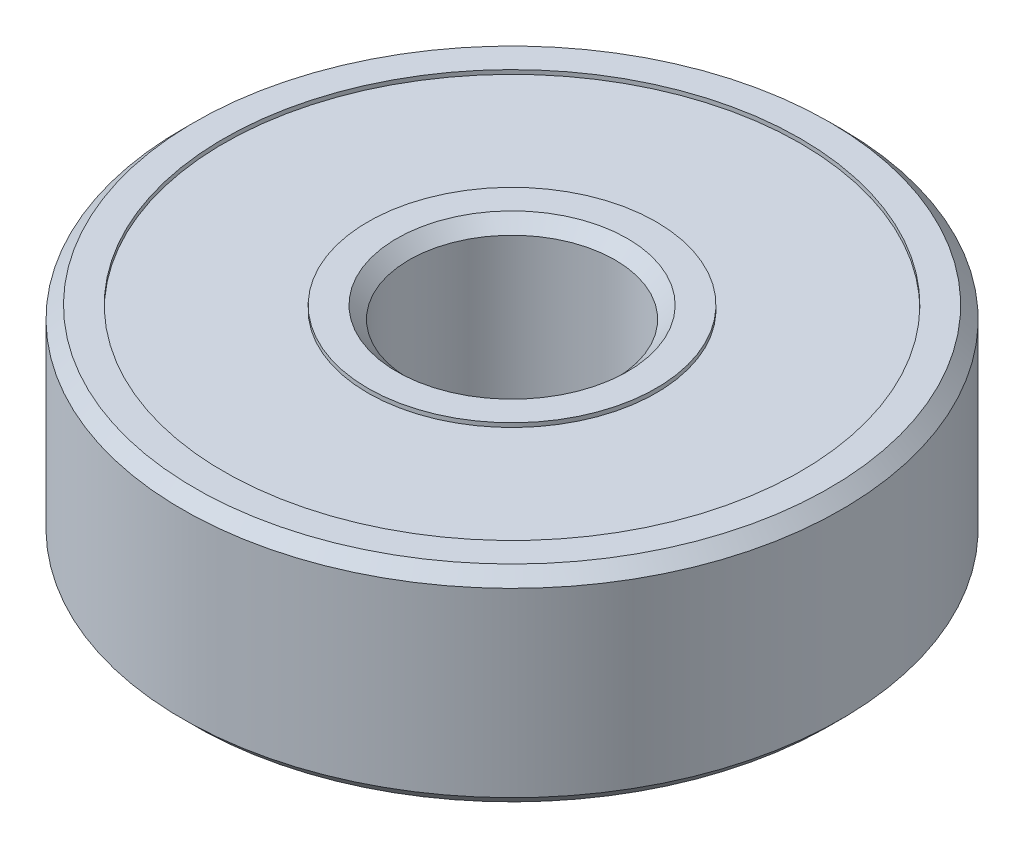
ISO-10303-21;
HEADER;
FILE_DESCRIPTION(('STEP AP214'),'2;1');
FILE_NAME('part.step','',(''),(''),'','','');
FILE_SCHEMA(('AUTOMOTIVE_DESIGN { 1 0 10303 214 1 1 1 1 }'));
ENDSEC;
DATA;
#1=APPLICATION_CONTEXT('core data for automotive mechanical design processes');
#2=APPLICATION_PROTOCOL_DEFINITION('international standard','automotive_design',2000,#1);
#3=PRODUCT_CONTEXT('',#1,'mechanical');
#4=PRODUCT('Part','Part','',(#3));
#5=PRODUCT_RELATED_PRODUCT_CATEGORY('part','',(#4));
#6=PRODUCT_DEFINITION_FORMATION('','',#4);
#7=PRODUCT_DEFINITION_CONTEXT('part definition',#1,'design');
#8=PRODUCT_DEFINITION('design','',#6,#7);
#9=PRODUCT_DEFINITION_SHAPE('','',#8);
#10=(LENGTH_UNIT() NAMED_UNIT(*) SI_UNIT(.MILLI.,.METRE.));
#11=(NAMED_UNIT(*) PLANE_ANGLE_UNIT() SI_UNIT($,.RADIAN.));
#12=(NAMED_UNIT(*) SI_UNIT($,.STERADIAN.) SOLID_ANGLE_UNIT());
#13=UNCERTAINTY_MEASURE_WITH_UNIT(LENGTH_MEASURE(1.E-05),#10,'distance_accuracy_value','');
#14=(GEOMETRIC_REPRESENTATION_CONTEXT(3) GLOBAL_UNCERTAINTY_ASSIGNED_CONTEXT((#13)) GLOBAL_UNIT_ASSIGNED_CONTEXT((#10,
#11,#12)) REPRESENTATION_CONTEXT('',''));
#15=CARTESIAN_POINT('',(0.,0.,0.));
#16=DIRECTION('',(0.,0.,1.));
#17=DIRECTION('',(1.,0.,0.));
#18=AXIS2_PLACEMENT_3D('',#15,#16,#17);
#19=CARTESIAN_POINT('',(0.,2.5,0.));
#20=DIRECTION('',(0.,1.,0.));
#21=DIRECTION('',(0.,0.,1.));
#22=AXIS2_PLACEMENT_3D('',#19,#20,#21);
#23=CONICAL_SURFACE('',#22,2.8,0.785398163397448);
#24=CARTESIAN_POINT('',(0.,2.2,0.));
#25=DIRECTION('',(0.,-1.,0.));
#26=DIRECTION('',(0.,0.,-1.));
#27=AXIS2_PLACEMENT_3D('',#24,#25,#26);
#28=CIRCLE('',#27,2.5);
#29=CARTESIAN_POINT('',(0.,2.2,-2.5));
#30=VERTEX_POINT('',#29);
#31=EDGE_CURVE('E87',#30,#30,#28,.T.);
#32=ORIENTED_EDGE('',*,*,#31,.T.);
#33=EDGE_LOOP('',(#32));
#34=FACE_BOUND('',#33,.T.);
#35=CARTESIAN_POINT('',(0.,2.5,0.));
#36=DIRECTION('',(0.,-1.,0.));
#37=DIRECTION('',(0.,0.,-1.));
#38=AXIS2_PLACEMENT_3D('',#35,#36,#37);
#39=CIRCLE('',#38,2.8);
#40=CARTESIAN_POINT('',(0.,2.5,-2.8));
#41=VERTEX_POINT('',#40);
#42=EDGE_CURVE('E10',#41,#41,#39,.T.);
#43=ORIENTED_EDGE('',*,*,#42,.F.);
#44=EDGE_LOOP('',(#43));
#45=FACE_BOUND('',#44,.T.);
#46=ADVANCED_FACE('F35',(#34,#45),#23,.F.);
#47=CARTESIAN_POINT('',(2.8,2.5,0.));
#48=DIRECTION('',(0.,1.,0.));
#49=DIRECTION('',(0.,0.,1.));
#50=AXIS2_PLACEMENT_3D('',#47,#48,#49);
#51=PLANE('',#50);
#52=ORIENTED_EDGE('',*,*,#42,.T.);
#53=EDGE_LOOP('',(#52));
#54=FACE_BOUND('',#53,.T.);
#55=CARTESIAN_POINT('',(0.,2.5,0.));
#56=DIRECTION('',(0.,-1.,0.));
#57=DIRECTION('',(0.,0.,-1.));
#58=AXIS2_PLACEMENT_3D('',#55,#56,#57);
#59=CIRCLE('',#58,3.5);
#60=CARTESIAN_POINT('',(0.,2.5,-3.5));
#61=VERTEX_POINT('',#60);
#62=EDGE_CURVE('E41',#61,#61,#59,.T.);
#63=ORIENTED_EDGE('',*,*,#62,.F.);
#64=EDGE_LOOP('',(#63));
#65=FACE_BOUND('',#64,.T.);
#66=ADVANCED_FACE('F105',(#54,#65),#51,.T.);
#67=CARTESIAN_POINT('',(0.,0.,0.));
#68=DIRECTION('',(0.,-1.,0.));
#69=DIRECTION('',(0.,0.,-1.));
#70=AXIS2_PLACEMENT_3D('',#67,#68,#69);
#71=CYLINDRICAL_SURFACE('',#70,3.5);
#72=ORIENTED_EDGE('',*,*,#62,.T.);
#73=EDGE_LOOP('',(#72));
#74=FACE_BOUND('',#73,.T.);
#75=CARTESIAN_POINT('',(0.,2.4,0.));
#76=DIRECTION('',(0.,-1.,0.));
#77=DIRECTION('',(0.,0.,-1.));
#78=AXIS2_PLACEMENT_3D('',#75,#76,#77);
#79=CIRCLE('',#78,3.5);
#80=CARTESIAN_POINT('',(0.,2.4,-3.5));
#81=VERTEX_POINT('',#80);
#82=EDGE_CURVE('E45',#81,#81,#79,.T.);
#83=ORIENTED_EDGE('',*,*,#82,.F.);
#84=EDGE_LOOP('',(#83));
#85=FACE_BOUND('',#84,.T.);
#86=ADVANCED_FACE('F109',(#74,#85),#71,.T.);
#87=CARTESIAN_POINT('',(3.5,2.4,0.));
#88=DIRECTION('',(0.,1.,0.));
#89=DIRECTION('',(0.,0.,1.));
#90=AXIS2_PLACEMENT_3D('',#87,#88,#89);
#91=PLANE('',#90);
#92=ORIENTED_EDGE('',*,*,#82,.T.);
#93=EDGE_LOOP('',(#92));
#94=FACE_BOUND('',#93,.T.);
#95=CARTESIAN_POINT('',(0.,2.4,0.));
#96=DIRECTION('',(0.,-1.,0.));
#97=DIRECTION('',(0.,0.,-1.));
#98=AXIS2_PLACEMENT_3D('',#95,#96,#97);
#99=CIRCLE('',#98,7.);
#100=CARTESIAN_POINT('',(0.,2.4,-7.));
#101=VERTEX_POINT('',#100);
#102=EDGE_CURVE('E49',#101,#101,#99,.T.);
#103=ORIENTED_EDGE('',*,*,#102,.F.);
#104=EDGE_LOOP('',(#103));
#105=FACE_BOUND('',#104,.T.);
#106=ADVANCED_FACE('F113',(#94,#105),#91,.T.);
#107=CARTESIAN_POINT('',(0.,0.,0.));
#108=DIRECTION('',(0.,-1.,0.));
#109=DIRECTION('',(0.,0.,-1.));
#110=AXIS2_PLACEMENT_3D('',#107,#108,#109);
#111=CYLINDRICAL_SURFACE('',#110,7.);
#112=ORIENTED_EDGE('',*,*,#102,.T.);
#113=EDGE_LOOP('',(#112));
#114=FACE_BOUND('',#113,.T.);
#115=CARTESIAN_POINT('',(0.,2.5,0.));
#116=DIRECTION('',(0.,-1.,0.));
#117=DIRECTION('',(0.,0.,-1.));
#118=AXIS2_PLACEMENT_3D('',#115,#116,#117);
#119=CIRCLE('',#118,7.);
#120=CARTESIAN_POINT('',(0.,2.5,-7.));
#121=VERTEX_POINT('',#120);
#122=EDGE_CURVE('E54',#121,#121,#119,.T.);
#123=ORIENTED_EDGE('',*,*,#122,.F.);
#124=EDGE_LOOP('',(#123));
#125=FACE_BOUND('',#124,.T.);
#126=ADVANCED_FACE('F119',(#114,#125),#111,.F.);
#127=CARTESIAN_POINT('',(7.,2.5,0.));
#128=DIRECTION('',(0.,1.,0.));
#129=DIRECTION('',(0.,0.,1.));
#130=AXIS2_PLACEMENT_3D('',#127,#128,#129);
#131=PLANE('',#130);
#132=ORIENTED_EDGE('',*,*,#122,.T.);
#133=EDGE_LOOP('',(#132));
#134=FACE_BOUND('',#133,.T.);
#135=CARTESIAN_POINT('',(0.,2.5,0.));
#136=DIRECTION('',(0.,-1.,0.));
#137=DIRECTION('',(0.,0.,-1.));
#138=AXIS2_PLACEMENT_3D('',#135,#136,#137);
#139=CIRCLE('',#138,7.7);
#140=CARTESIAN_POINT('',(0.,2.5,-7.7));
#141=VERTEX_POINT('',#140);
#142=EDGE_CURVE('E57',#141,#141,#139,.T.);
#143=ORIENTED_EDGE('',*,*,#142,.F.);
#144=EDGE_LOOP('',(#143));
#145=FACE_BOUND('',#144,.T.);
#146=ADVANCED_FACE('F123',(#134,#145),#131,.T.);
#147=CARTESIAN_POINT('',(0.,2.2,0.));
#148=DIRECTION('',(0.,-1.,0.));
#149=DIRECTION('',(0.,0.,-1.));
#150=AXIS2_PLACEMENT_3D('',#147,#148,#149);
#151=CONICAL_SURFACE('',#150,8.,0.785398163397448);
#152=ORIENTED_EDGE('',*,*,#142,.T.);
#153=EDGE_LOOP('',(#152));
#154=FACE_BOUND('',#153,.T.);
#155=CARTESIAN_POINT('',(0.,2.2,0.));
#156=DIRECTION('',(0.,-1.,0.));
#157=DIRECTION('',(0.,0.,-1.));
#158=AXIS2_PLACEMENT_3D('',#155,#156,#157);
#159=CIRCLE('',#158,8.);
#160=CARTESIAN_POINT('',(0.,2.2,-8.));
#161=VERTEX_POINT('',#160);
#162=EDGE_CURVE('E60',#161,#161,#159,.T.);
#163=ORIENTED_EDGE('',*,*,#162,.F.);
#164=EDGE_LOOP('',(#163));
#165=FACE_BOUND('',#164,.T.);
#166=ADVANCED_FACE('F127',(#154,#165),#151,.T.);
#167=CARTESIAN_POINT('',(0.,0.,0.));
#168=DIRECTION('',(0.,-1.,0.));
#169=DIRECTION('',(0.,0.,-1.));
#170=AXIS2_PLACEMENT_3D('',#167,#168,#169);
#171=CYLINDRICAL_SURFACE('',#170,8.);
#172=ORIENTED_EDGE('',*,*,#162,.T.);
#173=EDGE_LOOP('',(#172));
#174=FACE_BOUND('',#173,.T.);
#175=CARTESIAN_POINT('',(0.,-2.2,0.));
#176=DIRECTION('',(0.,-1.,0.));
#177=DIRECTION('',(0.,0.,-1.));
#178=AXIS2_PLACEMENT_3D('',#175,#176,#177);
#179=CIRCLE('',#178,8.);
#180=CARTESIAN_POINT('',(0.,-2.2,-8.));
#181=VERTEX_POINT('',#180);
#182=EDGE_CURVE('E63',#181,#181,#179,.T.);
#183=ORIENTED_EDGE('',*,*,#182,.F.);
#184=EDGE_LOOP('',(#183));
#185=FACE_BOUND('',#184,.T.);
#186=ADVANCED_FACE('F131',(#174,#185),#171,.T.);
#187=CARTESIAN_POINT('',(0.,-2.5,0.));
#188=DIRECTION('',(0.,1.,0.));
#189=DIRECTION('',(0.,0.,1.));
#190=AXIS2_PLACEMENT_3D('',#187,#188,#189);
#191=CONICAL_SURFACE('',#190,7.7,0.785398163397448);
#192=ORIENTED_EDGE('',*,*,#182,.T.);
#193=EDGE_LOOP('',(#192));
#194=FACE_BOUND('',#193,.T.);
#195=CARTESIAN_POINT('',(0.,-2.5,0.));
#196=DIRECTION('',(0.,-1.,0.));
#197=DIRECTION('',(0.,0.,-1.));
#198=AXIS2_PLACEMENT_3D('',#195,#196,#197);
#199=CIRCLE('',#198,7.7);
#200=CARTESIAN_POINT('',(0.,-2.5,-7.7));
#201=VERTEX_POINT('',#200);
#202=EDGE_CURVE('E66',#201,#201,#199,.T.);
#203=ORIENTED_EDGE('',*,*,#202,.F.);
#204=EDGE_LOOP('',(#203));
#205=FACE_BOUND('',#204,.T.);
#206=ADVANCED_FACE('F135',(#194,#205),#191,.T.);
#207=CARTESIAN_POINT('',(7.,-2.5,0.));
#208=DIRECTION('',(0.,-1.,0.));
#209=DIRECTION('',(0.,0.,-1.));
#210=AXIS2_PLACEMENT_3D('',#207,#208,#209);
#211=PLANE('',#210);
#212=ORIENTED_EDGE('',*,*,#202,.T.);
#213=EDGE_LOOP('',(#212));
#214=FACE_BOUND('',#213,.T.);
#215=CARTESIAN_POINT('',(0.,-2.5,0.));
#216=DIRECTION('',(0.,-1.,0.));
#217=DIRECTION('',(0.,0.,-1.));
#218=AXIS2_PLACEMENT_3D('',#215,#216,#217);
#219=CIRCLE('',#218,7.);
#220=CARTESIAN_POINT('',(0.,-2.5,-7.));
#221=VERTEX_POINT('',#220);
#222=EDGE_CURVE('E69',#221,#221,#219,.T.);
#223=ORIENTED_EDGE('',*,*,#222,.F.);
#224=EDGE_LOOP('',(#223));
#225=FACE_BOUND('',#224,.T.);
#226=ADVANCED_FACE('F139',(#214,#225),#211,.T.);
#227=CARTESIAN_POINT('',(0.,0.,0.));
#228=DIRECTION('',(0.,-1.,0.));
#229=DIRECTION('',(0.,0.,-1.));
#230=AXIS2_PLACEMENT_3D('',#227,#228,#229);
#231=CYLINDRICAL_SURFACE('',#230,7.);
#232=ORIENTED_EDGE('',*,*,#222,.T.);
#233=EDGE_LOOP('',(#232));
#234=FACE_BOUND('',#233,.T.);
#235=CARTESIAN_POINT('',(0.,-2.4,0.));
#236=DIRECTION('',(0.,-1.,0.));
#237=DIRECTION('',(0.,0.,-1.));
#238=AXIS2_PLACEMENT_3D('',#235,#236,#237);
#239=CIRCLE('',#238,7.);
#240=CARTESIAN_POINT('',(0.,-2.4,-7.));
#241=VERTEX_POINT('',#240);
#242=EDGE_CURVE('E72',#241,#241,#239,.T.);
#243=ORIENTED_EDGE('',*,*,#242,.F.);
#244=EDGE_LOOP('',(#243));
#245=FACE_BOUND('',#244,.T.);
#246=ADVANCED_FACE('F143',(#234,#245),#231,.F.);
#247=CARTESIAN_POINT('',(3.5,-2.4,0.));
#248=DIRECTION('',(0.,-1.,0.));
#249=DIRECTION('',(0.,0.,-1.));
#250=AXIS2_PLACEMENT_3D('',#247,#248,#249);
#251=PLANE('',#250);
#252=ORIENTED_EDGE('',*,*,#242,.T.);
#253=EDGE_LOOP('',(#252));
#254=FACE_BOUND('',#253,.T.);
#255=CARTESIAN_POINT('',(0.,-2.4,0.));
#256=DIRECTION('',(0.,-1.,0.));
#257=DIRECTION('',(0.,0.,-1.));
#258=AXIS2_PLACEMENT_3D('',#255,#256,#257);
#259=CIRCLE('',#258,3.5);
#260=CARTESIAN_POINT('',(0.,-2.4,-3.5));
#261=VERTEX_POINT('',#260);
#262=EDGE_CURVE('E75',#261,#261,#259,.T.);
#263=ORIENTED_EDGE('',*,*,#262,.F.);
#264=EDGE_LOOP('',(#263));
#265=FACE_BOUND('',#264,.T.);
#266=ADVANCED_FACE('F147',(#254,#265),#251,.T.);
#267=CARTESIAN_POINT('',(0.,0.,0.));
#268=DIRECTION('',(0.,-1.,0.));
#269=DIRECTION('',(0.,0.,-1.));
#270=AXIS2_PLACEMENT_3D('',#267,#268,#269);
#271=CYLINDRICAL_SURFACE('',#270,3.5);
#272=ORIENTED_EDGE('',*,*,#262,.T.);
#273=EDGE_LOOP('',(#272));
#274=FACE_BOUND('',#273,.T.);
#275=CARTESIAN_POINT('',(0.,-2.5,0.));
#276=DIRECTION('',(0.,-1.,0.));
#277=DIRECTION('',(0.,0.,-1.));
#278=AXIS2_PLACEMENT_3D('',#275,#276,#277);
#279=CIRCLE('',#278,3.5);
#280=CARTESIAN_POINT('',(0.,-2.5,-3.5));
#281=VERTEX_POINT('',#280);
#282=EDGE_CURVE('E78',#281,#281,#279,.T.);
#283=ORIENTED_EDGE('',*,*,#282,.F.);
#284=EDGE_LOOP('',(#283));
#285=FACE_BOUND('',#284,.T.);
#286=ADVANCED_FACE('F151',(#274,#285),#271,.T.);
#287=CARTESIAN_POINT('',(2.8,-2.5,0.));
#288=DIRECTION('',(0.,-1.,0.));
#289=DIRECTION('',(0.,0.,-1.));
#290=AXIS2_PLACEMENT_3D('',#287,#288,#289);
#291=PLANE('',#290);
#292=ORIENTED_EDGE('',*,*,#282,.T.);
#293=EDGE_LOOP('',(#292));
#294=FACE_BOUND('',#293,.T.);
#295=CARTESIAN_POINT('',(0.,-2.5,0.));
#296=DIRECTION('',(0.,-1.,0.));
#297=DIRECTION('',(0.,0.,-1.));
#298=AXIS2_PLACEMENT_3D('',#295,#296,#297);
#299=CIRCLE('',#298,2.8);
#300=CARTESIAN_POINT('',(0.,-2.5,-2.8));
#301=VERTEX_POINT('',#300);
#302=EDGE_CURVE('E81',#301,#301,#299,.T.);
#303=ORIENTED_EDGE('',*,*,#302,.F.);
#304=EDGE_LOOP('',(#303));
#305=FACE_BOUND('',#304,.T.);
#306=ADVANCED_FACE('F101',(#294,#305),#291,.T.);
#307=CARTESIAN_POINT('',(0.,-2.2,0.));
#308=DIRECTION('',(0.,-1.,0.));
#309=DIRECTION('',(0.,0.,-1.));
#310=AXIS2_PLACEMENT_3D('',#307,#308,#309);
#311=CONICAL_SURFACE('',#310,2.5,0.785398163397448);
#312=ORIENTED_EDGE('',*,*,#302,.T.);
#313=EDGE_LOOP('',(#312));
#314=FACE_BOUND('',#313,.T.);
#315=CARTESIAN_POINT('',(0.,-2.2,0.));
#316=DIRECTION('',(0.,-1.,0.));
#317=DIRECTION('',(0.,0.,-1.));
#318=AXIS2_PLACEMENT_3D('',#315,#316,#317);
#319=CIRCLE('',#318,2.5);
#320=CARTESIAN_POINT('',(0.,-2.2,-2.5));
#321=VERTEX_POINT('',#320);
#322=EDGE_CURVE('E84',#321,#321,#319,.T.);
#323=ORIENTED_EDGE('',*,*,#322,.F.);
#324=EDGE_LOOP('',(#323));
#325=FACE_BOUND('',#324,.T.);
#326=ADVANCED_FACE('F95',(#314,#325),#311,.F.);
#327=CARTESIAN_POINT('',(0.,0.,0.));
#328=DIRECTION('',(0.,-1.,0.));
#329=DIRECTION('',(0.,0.,-1.));
#330=AXIS2_PLACEMENT_3D('',#327,#328,#329);
#331=CYLINDRICAL_SURFACE('',#330,2.5);
#332=ORIENTED_EDGE('',*,*,#322,.T.);
#333=EDGE_LOOP('',(#332));
#334=FACE_BOUND('',#333,.T.);
#335=ORIENTED_EDGE('',*,*,#31,.F.);
#336=EDGE_LOOP('',(#335));
#337=FACE_BOUND('',#336,.T.);
#338=ADVANCED_FACE('F93',(#334,#337),#331,.F.);
#339=CLOSED_SHELL('',(#46,#66,#86,#106,#126,#146,#166,#186,#206,#226,#246,#266,#286,#306,#326,#338));
#340=MANIFOLD_SOLID_BREP('B2',#339);
#341=ADVANCED_BREP_SHAPE_REPRESENTATION('',(#18,#340),#14);
#342=SHAPE_DEFINITION_REPRESENTATION(#9,#341);
ENDSEC;
END-ISO-10303-21;
